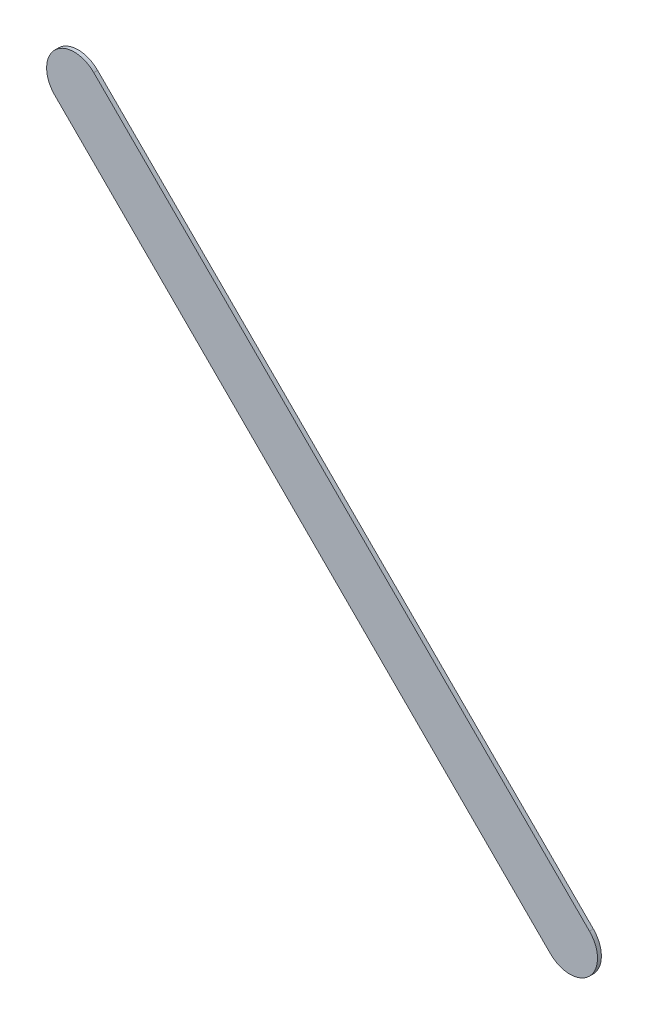
ISO-10303-21;
HEADER;
FILE_DESCRIPTION(('STEP AP214'),'2;1');
FILE_NAME('part.step','',(''),(''),'','','');
FILE_SCHEMA(('AUTOMOTIVE_DESIGN { 1 0 10303 214 1 1 1 1 }'));
ENDSEC;
DATA;
#1=APPLICATION_CONTEXT('core data for automotive mechanical design processes');
#2=APPLICATION_PROTOCOL_DEFINITION('international standard','automotive_design',2000,#1);
#3=PRODUCT_CONTEXT('',#1,'mechanical');
#4=PRODUCT('Part','Part','',(#3));
#5=PRODUCT_RELATED_PRODUCT_CATEGORY('part','',(#4));
#6=PRODUCT_DEFINITION_FORMATION('','',#4);
#7=PRODUCT_DEFINITION_CONTEXT('part definition',#1,'design');
#8=PRODUCT_DEFINITION('design','',#6,#7);
#9=PRODUCT_DEFINITION_SHAPE('','',#8);
#10=(LENGTH_UNIT() NAMED_UNIT(*) SI_UNIT(.MILLI.,.METRE.));
#11=(NAMED_UNIT(*) PLANE_ANGLE_UNIT() SI_UNIT($,.RADIAN.));
#12=(NAMED_UNIT(*) SI_UNIT($,.STERADIAN.) SOLID_ANGLE_UNIT());
#13=UNCERTAINTY_MEASURE_WITH_UNIT(LENGTH_MEASURE(1.E-05),#10,'distance_accuracy_value','');
#14=(GEOMETRIC_REPRESENTATION_CONTEXT(3) GLOBAL_UNCERTAINTY_ASSIGNED_CONTEXT((#13)) GLOBAL_UNIT_ASSIGNED_CONTEXT((#10,
#11,#12)) REPRESENTATION_CONTEXT('',''));
#15=CARTESIAN_POINT('',(0.,0.,0.));
#16=DIRECTION('',(0.,0.,1.));
#17=DIRECTION('',(1.,0.,0.));
#18=AXIS2_PLACEMENT_3D('',#15,#16,#17);
#19=CARTESIAN_POINT('',(170.003223,-125.144776,0.));
#20=DIRECTION('',(0.,0.,1.));
#21=DIRECTION('',(1.,0.,0.));
#22=AXIS2_PLACEMENT_3D('',#19,#20,#21);
#23=PLANE('',#22);
#24=DIRECTION('',(0.707106781186548,-0.707106781186548,0.));
#25=VECTOR('',#24,1.);
#26=CARTESIAN_POINT('',(170.003223,-125.144776,0.));
#27=LINE('',#26,#25);
#28=CARTESIAN_POINT('',(170.003223,-125.144776,0.));
#29=VERTEX_POINT('',#28);
#30=CARTESIAN_POINT('',(174.491223,-129.632776,0.));
#31=VERTEX_POINT('',#30);
#32=EDGE_CURVE('E84',#29,#31,#27,.T.);
#33=ORIENTED_EDGE('',*,*,#32,.T.);
#34=CARTESIAN_POINT('',(174.6679995,-129.4559995,0.));
#35=DIRECTION('',(0.,0.,1.));
#36=DIRECTION('',(-0.707106781187048,-0.707106781186048,0.));
#37=AXIS2_PLACEMENT_3D('',#34,#35,#36);
#38=CIRCLE('',#37,0.249999723809);
#39=CARTESIAN_POINT('',(174.844776,-129.279223,0.));
#40=VERTEX_POINT('',#39);
#41=EDGE_CURVE('E99',#31,#40,#38,.T.);
#42=ORIENTED_EDGE('',*,*,#41,.T.);
#43=DIRECTION('',(-0.707106781186548,0.707106781186548,0.));
#44=VECTOR('',#43,1.);
#45=CARTESIAN_POINT('',(174.844776,-129.279223,0.));
#46=LINE('',#45,#44);
#47=CARTESIAN_POINT('',(170.356776,-124.791223,0.));
#48=VERTEX_POINT('',#47);
#49=EDGE_CURVE('E21',#40,#48,#46,.T.);
#50=ORIENTED_EDGE('',*,*,#49,.T.);
#51=CARTESIAN_POINT('',(170.1799995,-124.9679995,0.));
#52=DIRECTION('',(0.,0.,1.));
#53=DIRECTION('',(0.707106781186548,0.707106781186548,0.));
#54=AXIS2_PLACEMENT_3D('',#51,#52,#53);
#55=CIRCLE('',#54,0.249999723809);
#56=EDGE_CURVE('E11',#48,#29,#55,.T.);
#57=ORIENTED_EDGE('',*,*,#56,.T.);
#58=EDGE_LOOP('',(#33,#42,#50,#57));
#59=FACE_BOUND('',#58,.T.);
#60=ADVANCED_FACE('F17',(#59),#23,.T.);
#61=CARTESIAN_POINT('',(170.003223,-125.144776,-0.035));
#62=DIRECTION('',(0.,0.,1.));
#63=DIRECTION('',(1.,0.,0.));
#64=AXIS2_PLACEMENT_3D('',#61,#62,#63);
#65=PLANE('',#64);
#66=CARTESIAN_POINT('',(170.1799995,-124.9679995,-0.035));
#67=DIRECTION('',(0.,0.,1.));
#68=DIRECTION('',(0.707106781186548,0.707106781186548,0.));
#69=AXIS2_PLACEMENT_3D('',#66,#67,#68);
#70=CIRCLE('',#69,0.249999723809);
#71=CARTESIAN_POINT('',(170.356776,-124.791223,-0.035));
#72=VERTEX_POINT('',#71);
#73=CARTESIAN_POINT('',(170.003223,-125.144776,-0.035));
#74=VERTEX_POINT('',#73);
#75=EDGE_CURVE('E27',#72,#74,#70,.T.);
#76=ORIENTED_EDGE('',*,*,#75,.F.);
#77=DIRECTION('',(-0.707106781186548,0.707106781186548,0.));
#78=VECTOR('',#77,1.);
#79=CARTESIAN_POINT('',(174.844776,-129.279223,-0.035));
#80=LINE('',#79,#78);
#81=CARTESIAN_POINT('',(174.844776,-129.279223,-0.035));
#82=VERTEX_POINT('',#81);
#83=EDGE_CURVE('E103',#82,#72,#80,.T.);
#84=ORIENTED_EDGE('',*,*,#83,.F.);
#85=CARTESIAN_POINT('',(174.6679995,-129.4559995,-0.035));
#86=DIRECTION('',(0.,0.,1.));
#87=DIRECTION('',(-0.707106781187048,-0.707106781186048,0.));
#88=AXIS2_PLACEMENT_3D('',#85,#86,#87);
#89=CIRCLE('',#88,0.249999723809);
#90=CARTESIAN_POINT('',(174.491223,-129.632776,-0.035));
#91=VERTEX_POINT('',#90);
#92=EDGE_CURVE('E86',#91,#82,#89,.T.);
#93=ORIENTED_EDGE('',*,*,#92,.F.);
#94=DIRECTION('',(0.707106781186548,-0.707106781186548,0.));
#95=VECTOR('',#94,1.);
#96=CARTESIAN_POINT('',(170.003223,-125.144776,-0.035));
#97=LINE('',#96,#95);
#98=EDGE_CURVE('E82',#74,#91,#97,.T.);
#99=ORIENTED_EDGE('',*,*,#98,.F.);
#100=EDGE_LOOP('',(#76,#84,#93,#99));
#101=FACE_BOUND('',#100,.T.);
#102=ADVANCED_FACE('F19',(#101),#65,.F.);
#103=CARTESIAN_POINT('',(170.1799995,-124.9679995,-0.035));
#104=DIRECTION('',(0.,0.,-1.));
#105=DIRECTION('',(0.707106781186548,0.707106781186548,0.));
#106=AXIS2_PLACEMENT_3D('',#103,#104,#105);
#107=CYLINDRICAL_SURFACE('',#106,0.249999723809);
#108=ORIENTED_EDGE('',*,*,#75,.T.);
#109=DIRECTION('',(0.,0.,1.));
#110=VECTOR('',#109,1.);
#111=CARTESIAN_POINT('',(170.003223,-125.144776,-0.035));
#112=LINE('',#111,#110);
#113=EDGE_CURVE('E71',#74,#29,#112,.T.);
#114=ORIENTED_EDGE('',*,*,#113,.T.);
#115=ORIENTED_EDGE('',*,*,#56,.F.);
#116=DIRECTION('',(0.,0.,1.));
#117=VECTOR('',#116,1.);
#118=CARTESIAN_POINT('',(170.356776,-124.791223,-0.035));
#119=LINE('',#118,#117);
#120=EDGE_CURVE('E74',#72,#48,#119,.T.);
#121=ORIENTED_EDGE('',*,*,#120,.F.);
#122=EDGE_LOOP('',(#108,#114,#115,#121));
#123=FACE_BOUND('',#122,.T.);
#124=ADVANCED_FACE('F70',(#123),#107,.T.);
#125=CARTESIAN_POINT('',(174.844776,-129.279223,-0.035));
#126=DIRECTION('',(-0.707106781186548,-0.707106781186548,0.));
#127=DIRECTION('',(-0.707106781186548,0.707106781186548,0.));
#128=AXIS2_PLACEMENT_3D('',#125,#126,#127);
#129=PLANE('',#128);
#130=ORIENTED_EDGE('',*,*,#83,.T.);
#131=ORIENTED_EDGE('',*,*,#120,.T.);
#132=ORIENTED_EDGE('',*,*,#49,.F.);
#133=DIRECTION('',(0.,0.,1.));
#134=VECTOR('',#133,1.);
#135=CARTESIAN_POINT('',(174.844776,-129.279223,-0.035));
#136=LINE('',#135,#134);
#137=EDGE_CURVE('E104',#82,#40,#136,.T.);
#138=ORIENTED_EDGE('',*,*,#137,.F.);
#139=EDGE_LOOP('',(#130,#131,#132,#138));
#140=FACE_BOUND('',#139,.T.);
#141=ADVANCED_FACE('F122',(#140),#129,.F.);
#142=CARTESIAN_POINT('',(174.6679995,-129.4559995,-0.035));
#143=DIRECTION('',(0.,0.,-1.));
#144=DIRECTION('',(-0.707106781187048,-0.707106781186048,0.));
#145=AXIS2_PLACEMENT_3D('',#142,#143,#144);
#146=CYLINDRICAL_SURFACE('',#145,0.249999723809);
#147=ORIENTED_EDGE('',*,*,#92,.T.);
#148=ORIENTED_EDGE('',*,*,#137,.T.);
#149=ORIENTED_EDGE('',*,*,#41,.F.);
#150=DIRECTION('',(0.,0.,1.));
#151=VECTOR('',#150,1.);
#152=CARTESIAN_POINT('',(174.491223,-129.632776,-0.035));
#153=LINE('',#152,#151);
#154=EDGE_CURVE('E91',#91,#31,#153,.T.);
#155=ORIENTED_EDGE('',*,*,#154,.F.);
#156=EDGE_LOOP('',(#147,#148,#149,#155));
#157=FACE_BOUND('',#156,.T.);
#158=ADVANCED_FACE('F124',(#157),#146,.T.);
#159=CARTESIAN_POINT('',(170.003223,-125.144776,-0.035));
#160=DIRECTION('',(0.707106781186548,0.707106781186548,0.));
#161=DIRECTION('',(0.,0.,-1.));
#162=AXIS2_PLACEMENT_3D('',#159,#160,#161);
#163=PLANE('',#162);
#164=ORIENTED_EDGE('',*,*,#98,.T.);
#165=ORIENTED_EDGE('',*,*,#154,.T.);
#166=ORIENTED_EDGE('',*,*,#32,.F.);
#167=ORIENTED_EDGE('',*,*,#113,.F.);
#168=EDGE_LOOP('',(#164,#165,#166,#167));
#169=FACE_BOUND('',#168,.T.);
#170=ADVANCED_FACE('F80',(#169),#163,.F.);
#171=CLOSED_SHELL('',(#60,#102,#124,#141,#158,#170));
#172=MANIFOLD_SOLID_BREP('B1',#171);
#173=ADVANCED_BREP_SHAPE_REPRESENTATION('',(#18,#172),#14);
#174=SHAPE_DEFINITION_REPRESENTATION(#9,#173);
ENDSEC;
END-ISO-10303-21;
